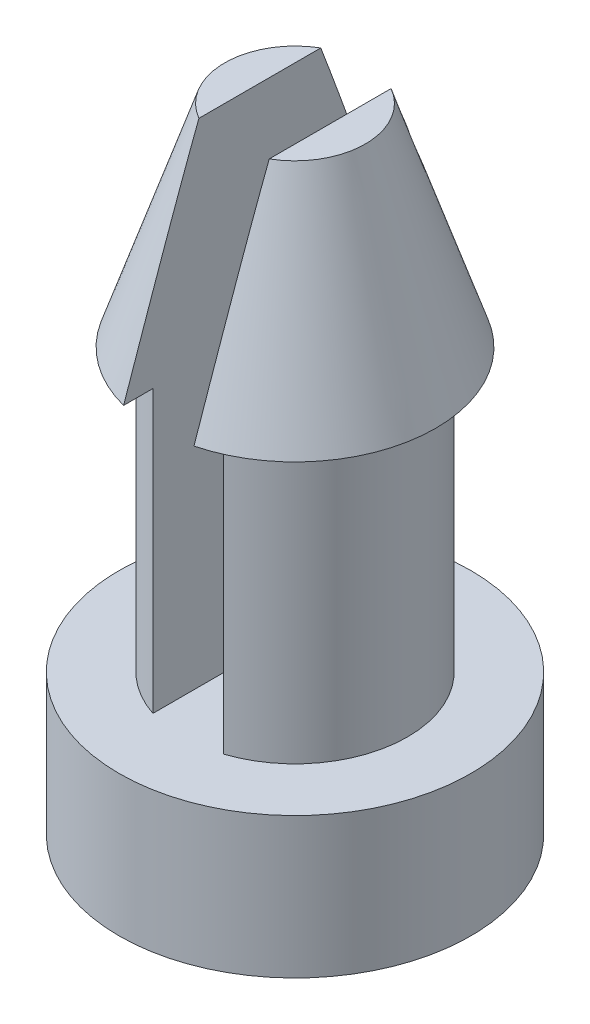
ISO-10303-21;
HEADER;
FILE_DESCRIPTION(('STEP AP214'),'2;1');
FILE_NAME('part.step','',(''),(''),'','','');
FILE_SCHEMA(('AUTOMOTIVE_DESIGN { 1 0 10303 214 1 1 1 1 }'));
ENDSEC;
DATA;
#1=APPLICATION_CONTEXT('core data for automotive mechanical design processes');
#2=APPLICATION_PROTOCOL_DEFINITION('international standard','automotive_design',2000,#1);
#3=PRODUCT_CONTEXT('',#1,'mechanical');
#4=PRODUCT('Part','Part','',(#3));
#5=PRODUCT_RELATED_PRODUCT_CATEGORY('part','',(#4));
#6=PRODUCT_DEFINITION_FORMATION('','',#4);
#7=PRODUCT_DEFINITION_CONTEXT('part definition',#1,'design');
#8=PRODUCT_DEFINITION('design','',#6,#7);
#9=PRODUCT_DEFINITION_SHAPE('','',#8);
#10=(LENGTH_UNIT() NAMED_UNIT(*) SI_UNIT(.MILLI.,.METRE.));
#11=(NAMED_UNIT(*) PLANE_ANGLE_UNIT() SI_UNIT($,.RADIAN.));
#12=(NAMED_UNIT(*) SI_UNIT($,.STERADIAN.) SOLID_ANGLE_UNIT());
#13=UNCERTAINTY_MEASURE_WITH_UNIT(LENGTH_MEASURE(1.E-05),#10,'distance_accuracy_value','');
#14=(GEOMETRIC_REPRESENTATION_CONTEXT(3) GLOBAL_UNCERTAINTY_ASSIGNED_CONTEXT((#13)) GLOBAL_UNIT_ASSIGNED_CONTEXT((#10,
#11,#12)) REPRESENTATION_CONTEXT('',''));
#15=CARTESIAN_POINT('',(0.,0.,0.));
#16=DIRECTION('',(0.,0.,1.));
#17=DIRECTION('',(1.,0.,0.));
#18=AXIS2_PLACEMENT_3D('',#15,#16,#17);
#19=CARTESIAN_POINT('',(0.,0.,0.));
#20=DIRECTION('',(0.,-1.,0.));
#21=DIRECTION('',(0.,0.,-1.));
#22=AXIS2_PLACEMENT_3D('',#19,#20,#21);
#23=CYLINDRICAL_SURFACE('',#22,2.54);
#24=DIRECTION('',(0.,-1.,0.));
#25=VECTOR('',#24,1.);
#26=CARTESIAN_POINT('',(-0.793749999999998,0.,-2.41279110937934));
#27=LINE('',#26,#25);
#28=CARTESIAN_POINT('',(-0.793749999999998,3.175,-2.41279110937934));
#29=VERTEX_POINT('',#28);
#30=CARTESIAN_POINT('',(-0.793749999999999,9.525,-2.41279110937934));
#31=VERTEX_POINT('',#30);
#32=EDGE_CURVE('E148',#29,#31,#27,.F.);
#33=ORIENTED_EDGE('',*,*,#32,.F.);
#34=CARTESIAN_POINT('',(0.,3.175,0.));
#35=DIRECTION('',(0.,-1.,0.));
#36=DIRECTION('',(0.,0.,-1.));
#37=AXIS2_PLACEMENT_3D('',#34,#35,#36);
#38=CIRCLE('',#37,2.54);
#39=CARTESIAN_POINT('',(-0.793749999999998,3.175,2.41279110937934));
#40=VERTEX_POINT('',#39);
#41=EDGE_CURVE('E125',#40,#29,#38,.T.);
#42=ORIENTED_EDGE('',*,*,#41,.F.);
#43=DIRECTION('',(0.,-1.,0.));
#44=VECTOR('',#43,1.);
#45=CARTESIAN_POINT('',(-0.793749999999998,0.,2.41279110937934));
#46=LINE('',#45,#44);
#47=CARTESIAN_POINT('',(-0.793749999999999,9.525,2.41279110937934));
#48=VERTEX_POINT('',#47);
#49=EDGE_CURVE('E146',#48,#40,#46,.T.);
#50=ORIENTED_EDGE('',*,*,#49,.F.);
#51=CARTESIAN_POINT('',(0.,9.525,0.));
#52=DIRECTION('',(0.,-1.,0.));
#53=DIRECTION('',(0.,0.,-1.));
#54=AXIS2_PLACEMENT_3D('',#51,#52,#53);
#55=CIRCLE('',#54,2.54);
#56=EDGE_CURVE('E131',#48,#31,#55,.T.);
#57=ORIENTED_EDGE('',*,*,#56,.T.);
#58=EDGE_LOOP('',(#33,#42,#50,#57));
#59=FACE_BOUND('',#58,.T.);
#60=ADVANCED_FACE('F41',(#59),#23,.T.);
#61=CARTESIAN_POINT('',(0.,9.525,0.));
#62=DIRECTION('',(0.,1.,0.));
#63=DIRECTION('',(0.,0.,1.));
#64=AXIS2_PLACEMENT_3D('',#61,#62,#63);
#65=PLANE('',#64);
#66=CARTESIAN_POINT('',(0.,9.525,0.));
#67=DIRECTION('',(0.,-1.,0.));
#68=DIRECTION('',(0.,0.,-1.));
#69=AXIS2_PLACEMENT_3D('',#66,#67,#68);
#70=CIRCLE('',#69,3.175);
#71=CARTESIAN_POINT('',(-0.793749999999999,9.525,3.07418053105214));
#72=VERTEX_POINT('',#71);
#73=CARTESIAN_POINT('',(-0.793749999999999,9.525,-3.07418053105214));
#74=VERTEX_POINT('',#73);
#75=EDGE_CURVE('E135',#72,#74,#70,.T.);
#76=ORIENTED_EDGE('',*,*,#75,.T.);
#77=DIRECTION('',(0.,0.,1.));
#78=VECTOR('',#77,1.);
#79=CARTESIAN_POINT('',(-0.793749999999999,9.525,0.));
#80=LINE('',#79,#78);
#81=EDGE_CURVE('E151',#74,#31,#80,.T.);
#82=ORIENTED_EDGE('',*,*,#81,.T.);
#83=ORIENTED_EDGE('',*,*,#56,.F.);
#84=EDGE_CURVE('E64',#48,#72,#80,.T.);
#85=ORIENTED_EDGE('',*,*,#84,.T.);
#86=EDGE_LOOP('',(#76,#82,#83,#85));
#87=FACE_BOUND('',#86,.T.);
#88=ADVANCED_FACE('F193',(#87),#65,.F.);
#89=CARTESIAN_POINT('',(0.,14.2875,0.));
#90=DIRECTION('',(0.,-1.,0.));
#91=DIRECTION('',(0.,0.,-1.));
#92=AXIS2_PLACEMENT_3D('',#89,#90,#91);
#93=CONICAL_SURFACE('',#92,1.5875,0.321750554396642);
#94=ORIENTED_EDGE('',*,*,#75,.F.);
#95=CARTESIAN_POINT('',(-0.793749999999999,9.5243,3.07442151609227));
#96=CARTESIAN_POINT('',(-0.793749999999999,9.70864325367533,3.01095661412919));
#97=CARTESIAN_POINT('',(-0.793749999999999,9.89295019709172,2.94738593836572));
#98=CARTESIAN_POINT('',(-0.793749999999999,10.2614733172808,2.81997730621189));
#99=CARTESIAN_POINT('',(-0.793749999999999,10.4456894933135,2.75613934768174));
#100=CARTESIAN_POINT('',(-0.793749999999999,10.9989822327712,2.56386028566071));
#101=CARTESIAN_POINT('',(-0.79375,11.3678900025934,2.43493334350211));
#102=CARTESIAN_POINT('',(-0.79375,12.1271676755757,2.16727681690671));
#103=CARTESIAN_POINT('',(-0.79375,12.5174943712571,2.02842392422531));
#104=CARTESIAN_POINT('',(-0.79375,13.1014662428339,1.81723841588544));
#105=CARTESIAN_POINT('',(-0.79375,13.2956641271333,1.7464359655978));
#106=CARTESIAN_POINT('',(-0.79375,13.6835127099418,1.60337831773535));
#107=CARTESIAN_POINT('',(-0.79375,13.8771634419601,1.53112321142561));
#108=CARTESIAN_POINT('',(-0.79375,14.1726002482872,1.41898752660588));
#109=CARTESIAN_POINT('',(-0.79375,14.2746840694561,1.37989196078648));
#110=CARTESIAN_POINT('',(-0.79375,14.4785650982894,1.30091108813334));
#111=CARTESIAN_POINT('',(-0.79375,14.5803622578216,1.2610256567681));
#112=CARTESIAN_POINT('',(-0.79375,14.7840988690684,1.18001768376987));
#113=CARTESIAN_POINT('',(-0.79375,14.8860361372565,1.13888963873966));
#114=CARTESIAN_POINT('',(-0.79375,15.0892896591,1.05526736567719));
#115=CARTESIAN_POINT('',(-0.79375,15.1906062097077,1.01277386353));
#116=CARTESIAN_POINT('',(-0.79375,15.3901917608087,0.926784972069538));
#117=CARTESIAN_POINT('',(-0.79375,15.4884789296943,0.883331864248625));
#118=CARTESIAN_POINT('',(-0.79375,15.6840109509216,0.793602865785596));
#119=CARTESIAN_POINT('',(-0.79375,15.7812534056772,0.74732165208845));
#120=CARTESIAN_POINT('',(-0.79375,15.9250162738515,0.674787197952603));
#121=CARTESIAN_POINT('',(-0.79375,15.9723785153785,0.650207813661779));
#122=CARTESIAN_POINT('',(-0.79375,16.0663151545602,0.59959342431616));
#123=CARTESIAN_POINT('',(-0.79375,16.1128897058036,0.573558707394662));
#124=CARTESIAN_POINT('',(-0.79375,16.2047277572804,0.519578551109119));
#125=CARTESIAN_POINT('',(-0.79375,16.2499948975128,0.491639332514471));
#126=CARTESIAN_POINT('',(-0.79375,16.3386476211257,0.432941943196636));
#127=CARTESIAN_POINT('',(-0.79375,16.382035553104,0.402187450040028));
#128=CARTESIAN_POINT('',(-0.79375,16.4392148245302,0.356982845465313));
#129=CARTESIAN_POINT('',(-0.79375,16.4544897182994,0.34441512993058));
#130=CARTESIAN_POINT('',(-0.79375,16.4844153522136,0.31853238205921));
#131=CARTESIAN_POINT('',(-0.79375,16.4990656816962,0.305216870969121));
#132=CARTESIAN_POINT('',(-0.79375,16.5274476438287,0.277769771660078));
#133=CARTESIAN_POINT('',(-0.79375,16.5411834949467,0.263642585952983));
#134=CARTESIAN_POINT('',(-0.79375,16.5674881869694,0.234348062735739));
#135=CARTESIAN_POINT('',(-0.79375,16.5800580534197,0.2191816600873));
#136=CARTESIAN_POINT('',(-0.79375,16.6030780563985,0.188269478285022));
#137=CARTESIAN_POINT('',(-0.79375,16.6135945581486,0.172573940301297));
#138=CARTESIAN_POINT('',(-0.79375,16.6325127179093,0.139919323782055));
#139=CARTESIAN_POINT('',(-0.79375,16.6409143740774,0.122960244145779));
#140=CARTESIAN_POINT('',(-0.79375,16.6537539384199,0.0904427195819594));
#141=CARTESIAN_POINT('',(-0.79375,16.6585936509673,0.0750465017342836));
#142=CARTESIAN_POINT('',(-0.79375,16.6656085136102,0.0436682626040638));
#143=CARTESIAN_POINT('',(-0.79375,16.6677887236516,0.0276874135199858));
#144=CARTESIAN_POINT('',(-0.79375,16.669202164822,-0.00447448282048815));
#145=CARTESIAN_POINT('',(-0.79375,16.6684234260672,-0.0206560787263561));
#146=CARTESIAN_POINT('',(-0.79375,16.6640046162712,-0.0526288676738726));
#147=CARTESIAN_POINT('',(-0.79375,16.6603606803324,-0.0684195036465102));
#148=CARTESIAN_POINT('',(-0.79375,16.6492452828165,-0.103707915296005));
#149=CARTESIAN_POINT('',(-0.79375,16.6409684594983,-0.122946903540195));
#150=CARTESIAN_POINT('',(-0.79375,16.6215310760103,-0.15989670333274));
#151=CARTESIAN_POINT('',(-0.79375,16.61036352903,-0.177603671720214));
#152=CARTESIAN_POINT('',(-0.79375,16.5750478178075,-0.227074752474278));
#153=CARTESIAN_POINT('',(-0.79375,16.5483339119709,-0.256970757553489));
#154=CARTESIAN_POINT('',(-0.79375,16.4913642240698,-0.3131411539281));
#155=CARTESIAN_POINT('',(-0.79375,16.4610950340029,-0.339400965050731));
#156=CARTESIAN_POINT('',(-0.79375,16.3978056463724,-0.389960817514382));
#157=CARTESIAN_POINT('',(-0.79375,16.3647375000604,-0.414200263239289));
#158=CARTESIAN_POINT('',(-0.79375,16.29727750224,-0.46077748494907));
#159=CARTESIAN_POINT('',(-0.79375,16.2628846848185,-0.483113833615575));
#160=CARTESIAN_POINT('',(-0.79375,16.1582558863592,-0.548131946140139));
#161=CARTESIAN_POINT('',(-0.79375,16.0867214367784,-0.588710682721495));
#162=CARTESIAN_POINT('',(-0.79375,15.9415416139269,-0.666703447878918));
#163=CARTESIAN_POINT('',(-0.79375,15.8678874740316,-0.704100637506216));
#164=CARTESIAN_POINT('',(-0.79375,15.7195920719858,-0.776571748578168));
#165=CARTESIAN_POINT('',(-0.79375,15.6449525436175,-0.811649229808802));
#166=CARTESIAN_POINT('',(-0.79375,15.495985753687,-0.879738598773763));
#167=CARTESIAN_POINT('',(-0.79375,15.4216683743195,-0.912772297165253));
#168=CARTESIAN_POINT('',(-0.79375,15.2725301448295,-0.977685887568333));
#169=CARTESIAN_POINT('',(-0.79375,15.197709278607,-1.00956574247343));
#170=CARTESIAN_POINT('',(-0.79375,14.9726747342844,-1.10390410527154));
#171=CARTESIAN_POINT('',(-0.79375,14.8219124181898,-1.1650509954539));
#172=CARTESIAN_POINT('',(-0.79375,14.5193595272673,-1.28520773492084));
#173=CARTESIAN_POINT('',(-0.79375,14.3675680220554,-1.34421521870201));
#174=CARTESIAN_POINT('',(-0.79375,14.063419065364,-1.46070911125684));
#175=CARTESIAN_POINT('',(-0.79375,13.9110616656244,-1.51819565536786));
#176=CARTESIAN_POINT('',(-0.79375,13.606598143186,-1.63183993399551));
#177=CARTESIAN_POINT('',(-0.79375,13.4544937492315,-1.68800231326989));
#178=CARTESIAN_POINT('',(-0.79375,13.1499873800809,-1.79952383731553));
#179=CARTESIAN_POINT('',(-0.79375,12.9975853983797,-1.85488296429949));
#180=CARTESIAN_POINT('',(-0.79375,12.5401839546664,-2.01999898298752));
#181=CARTESIAN_POINT('',(-0.79375,12.2348554884836,-2.12884391387009));
#182=CARTESIAN_POINT('',(-0.79375,11.7294311475977,-2.30760272031446));
#183=CARTESIAN_POINT('',(-0.79375,11.5294887208131,-2.37795241074788));
#184=CARTESIAN_POINT('',(-0.79375,11.1294013624571,-2.5181511338395));
#185=CARTESIAN_POINT('',(-0.79375,10.9292564094598,-2.5880001053903));
#186=CARTESIAN_POINT('',(-0.79375,10.5283602742576,-2.72746492301838));
#187=CARTESIAN_POINT('',(-0.793749999999999,10.3276087694937,-2.7970798409416));
#188=CARTESIAN_POINT('',(-0.793749999999999,9.92601900355539,-2.9359782482437));
#189=CARTESIAN_POINT('',(-0.793749999999999,9.72518075623715,-3.00526177767588));
#190=CARTESIAN_POINT('',(-0.793749999999999,9.5243,-3.07442151609229));
#191=B_SPLINE_CURVE_WITH_KNOTS('',3,(#95,#96,#97,#98,#99,#100,#101,#102,#103,#104,#105,#106,
#107,#108,#109,#110,#111,#112,#113,#114,#115,#116,#117,#118,#119,#120,#121,#122,#123,#124,#125,
#126,#127,#128,#129,#130,#131,#132,#133,#134,#135,#136,#137,#138,#139,#140,#141,#142,#143,#144,
#145,#146,#147,#148,#149,#150,#151,#152,#153,#154,#155,#156,#157,#158,#159,#160,#161,#162,#163,
#164,#165,#166,#167,#168,#169,#170,#171,#172,#173,#174,#175,#176,#177,#178,#179,#180,#181,#182,
#183,#184,#185,#186,#187,#188,#189,#190),.UNSPECIFIED.,.F.,.F.,(4,2,2,2,2,2,2,2,2,2,2,2,2,2,2,2,
2,2,2,2,2,2,2,2,2,2,2,2,2,2,2,2,2,2,2,2,2,2,2,2,2,2,2,2,2,2,2,4),(0.,0.584886487856575,
1.16977766711163,2.34213898497468,3.5849890847832,4.20509239906185,4.82515687550908,
5.15309681144134,5.48108886917711,5.81084641898107,6.14043147711937,6.46280324474104,
6.78580167640717,6.94586602094756,7.10589878670319,7.2654317961233,7.42475930458722,
7.48408292374499,7.54344496589466,7.60251087093547,7.66152432173749,7.71808625252809,
7.77464823259427,7.82286960212244,7.87099908228231,7.91932346830254,7.96771315170812,
8.03018774688744,8.09281477501431,8.21242194555966,8.33249562008661,8.4553924936856,
8.57838074285677,8.82492156170467,9.07269514957584,9.3200792347008,9.56405265902934,
9.80803392234936,10.2960730135332,10.7846362135242,11.2731557926104,11.7595783639008,
12.2460116902005,13.2184512999501,13.8543239397936,14.4902729033198,15.1277101866306,
15.7650683738438),.UNSPECIFIED.);
#192=CARTESIAN_POINT('',(-0.79375,14.2875,1.3748153285078));
#193=VERTEX_POINT('',#192);
#194=EDGE_CURVE('E150',#72,#193,#191,.T.);
#195=ORIENTED_EDGE('',*,*,#194,.T.);
#196=CARTESIAN_POINT('',(0.,14.2875,0.));
#197=DIRECTION('',(0.,-1.,0.));
#198=DIRECTION('',(0.,0.,-1.));
#199=AXIS2_PLACEMENT_3D('',#196,#197,#198);
#200=CIRCLE('',#199,1.5875);
#201=CARTESIAN_POINT('',(-0.79375,14.2875,-1.3748153285078));
#202=VERTEX_POINT('',#201);
#203=EDGE_CURVE('E139',#193,#202,#200,.T.);
#204=ORIENTED_EDGE('',*,*,#203,.T.);
#205=EDGE_CURVE('E115',#202,#74,#191,.T.);
#206=ORIENTED_EDGE('',*,*,#205,.T.);
#207=EDGE_LOOP('',(#94,#195,#204,#206));
#208=FACE_BOUND('',#207,.T.);
#209=ADVANCED_FACE('F188',(#208),#93,.T.);
#210=CARTESIAN_POINT('',(0.,14.2875,0.));
#211=DIRECTION('',(0.,-1.,0.));
#212=DIRECTION('',(0.,0.,-1.));
#213=AXIS2_PLACEMENT_3D('',#210,#211,#212);
#214=PLANE('',#213);
#215=ORIENTED_EDGE('',*,*,#203,.F.);
#216=DIRECTION('',(0.,0.,-1.));
#217=VECTOR('',#216,1.);
#218=CARTESIAN_POINT('',(-0.79375,14.2875,0.));
#219=LINE('',#218,#217);
#220=EDGE_CURVE('E11',#193,#202,#219,.T.);
#221=ORIENTED_EDGE('',*,*,#220,.T.);
#222=EDGE_LOOP('',(#215,#221));
#223=FACE_BOUND('',#222,.T.);
#224=ADVANCED_FACE('F182',(#223),#214,.F.);
#225=CARTESIAN_POINT('',(0.,3.175,0.));
#226=DIRECTION('',(0.,1.,0.));
#227=DIRECTION('',(0.,0.,1.));
#228=AXIS2_PLACEMENT_3D('',#225,#226,#227);
#229=PLANE('',#228);
#230=ORIENTED_EDGE('',*,*,#41,.T.);
#231=DIRECTION('',(0.,0.,1.));
#232=VECTOR('',#231,1.);
#233=CARTESIAN_POINT('',(-0.793749999999998,3.175,-3.96875));
#234=LINE('',#233,#232);
#235=EDGE_CURVE('E121',#29,#40,#234,.T.);
#236=ORIENTED_EDGE('',*,*,#235,.T.);
#237=EDGE_LOOP('',(#230,#236));
#238=FACE_BOUND('',#237,.T.);
#239=CARTESIAN_POINT('',(0.793749999999998,3.175,-2.41279110937934));
#240=VERTEX_POINT('',#239);
#241=CARTESIAN_POINT('',(0.793749999999998,3.175,2.41279110937934));
#242=VERTEX_POINT('',#241);
#243=EDGE_CURVE('E120',#240,#242,#38,.T.);
#244=ORIENTED_EDGE('',*,*,#243,.T.);
#245=DIRECTION('',(0.,0.,1.));
#246=VECTOR('',#245,1.);
#247=CARTESIAN_POINT('',(0.793749999999998,3.175,-3.96875));
#248=LINE('',#247,#246);
#249=EDGE_CURVE('E107',#240,#242,#248,.T.);
#250=ORIENTED_EDGE('',*,*,#249,.F.);
#251=EDGE_LOOP('',(#244,#250));
#252=FACE_BOUND('',#251,.T.);
#253=CARTESIAN_POINT('',(0.,3.175,0.));
#254=DIRECTION('',(0.,-1.,0.));
#255=DIRECTION('',(0.,0.,-1.));
#256=AXIS2_PLACEMENT_3D('',#253,#254,#255);
#257=CIRCLE('',#256,3.96875);
#258=CARTESIAN_POINT('',(0.,3.175,-3.96875));
#259=VERTEX_POINT('',#258);
#260=EDGE_CURVE('E143',#259,#259,#257,.T.);
#261=ORIENTED_EDGE('',*,*,#260,.F.);
#262=EDGE_LOOP('',(#261));
#263=FACE_BOUND('',#262,.T.);
#264=ADVANCED_FACE('F43',(#238,#252,#263),#229,.T.);
#265=DIRECTION('',(0.,-1.,0.));
#266=VECTOR('',#265,1.);
#267=CARTESIAN_POINT('',(0.793749999999998,0.,2.41279110937934));
#268=LINE('',#267,#266);
#269=CARTESIAN_POINT('',(0.793749999999999,9.525,2.41279110937934));
#270=VERTEX_POINT('',#269);
#271=EDGE_CURVE('E124',#242,#270,#268,.F.);
#272=ORIENTED_EDGE('',*,*,#271,.F.);
#273=ORIENTED_EDGE('',*,*,#243,.F.);
#274=DIRECTION('',(0.,-1.,0.));
#275=VECTOR('',#274,1.);
#276=CARTESIAN_POINT('',(0.793749999999998,0.,-2.41279110937934));
#277=LINE('',#276,#275);
#278=CARTESIAN_POINT('',(0.793749999999999,9.525,-2.41279110937934));
#279=VERTEX_POINT('',#278);
#280=EDGE_CURVE('E104',#279,#240,#277,.T.);
#281=ORIENTED_EDGE('',*,*,#280,.F.);
#282=EDGE_CURVE('E128',#279,#270,#55,.T.);
#283=ORIENTED_EDGE('',*,*,#282,.T.);
#284=EDGE_LOOP('',(#272,#273,#281,#283));
#285=FACE_BOUND('',#284,.T.);
#286=ADVANCED_FACE('F123',(#285),#23,.T.);
#287=CARTESIAN_POINT('',(0.793749999999999,9.525,-3.07418053105214));
#288=VERTEX_POINT('',#287);
#289=CARTESIAN_POINT('',(0.793749999999999,9.525,3.07418053105214));
#290=VERTEX_POINT('',#289);
#291=EDGE_CURVE('E132',#288,#290,#70,.T.);
#292=ORIENTED_EDGE('',*,*,#291,.T.);
#293=DIRECTION('',(0.,0.,-1.));
#294=VECTOR('',#293,1.);
#295=CARTESIAN_POINT('',(0.793749999999999,9.525,0.));
#296=LINE('',#295,#294);
#297=EDGE_CURVE('E301',#290,#270,#296,.T.);
#298=ORIENTED_EDGE('',*,*,#297,.T.);
#299=ORIENTED_EDGE('',*,*,#282,.F.);
#300=EDGE_CURVE('E110',#279,#288,#296,.T.);
#301=ORIENTED_EDGE('',*,*,#300,.T.);
#302=EDGE_LOOP('',(#292,#298,#299,#301));
#303=FACE_BOUND('',#302,.T.);
#304=ADVANCED_FACE('F186',(#303),#65,.F.);
#305=ORIENTED_EDGE('',*,*,#291,.F.);
#306=CARTESIAN_POINT('',(0.793749999999999,9.5243,-3.07442151609227));
#307=CARTESIAN_POINT('',(0.793749999999999,9.70864325367533,-3.01095661412919));
#308=CARTESIAN_POINT('',(0.793749999999999,9.89295019709172,-2.94738593836572));
#309=CARTESIAN_POINT('',(0.793749999999999,10.2614733172808,-2.81997730621189));
#310=CARTESIAN_POINT('',(0.793749999999999,10.4456894933135,-2.75613934768174));
#311=CARTESIAN_POINT('',(0.793749999999999,10.9989822327712,-2.56386028566071));
#312=CARTESIAN_POINT('',(0.79375,11.3678900025934,-2.43493334350211));
#313=CARTESIAN_POINT('',(0.79375,12.1271676755757,-2.16727681690671));
#314=CARTESIAN_POINT('',(0.79375,12.5174943712571,-2.02842392422531));
#315=CARTESIAN_POINT('',(0.79375,13.1014662428339,-1.81723841588544));
#316=CARTESIAN_POINT('',(0.79375,13.2956641271333,-1.7464359655978));
#317=CARTESIAN_POINT('',(0.79375,13.6835127099418,-1.60337831773535));
#318=CARTESIAN_POINT('',(0.79375,13.8771634419601,-1.53112321142561));
#319=CARTESIAN_POINT('',(0.79375,14.1726002482872,-1.41898752660588));
#320=CARTESIAN_POINT('',(0.79375,14.2746840694561,-1.37989196078648));
#321=CARTESIAN_POINT('',(0.79375,14.4785650982894,-1.30091108813334));
#322=CARTESIAN_POINT('',(0.79375,14.5803622578216,-1.2610256567681));
#323=CARTESIAN_POINT('',(0.79375,14.7840988690684,-1.18001768376987));
#324=CARTESIAN_POINT('',(0.79375,14.8860361372565,-1.13888963873966));
#325=CARTESIAN_POINT('',(0.79375,15.0892896591,-1.05526736567719));
#326=CARTESIAN_POINT('',(0.79375,15.1906062097077,-1.01277386353));
#327=CARTESIAN_POINT('',(0.79375,15.3901917608087,-0.926784972069538));
#328=CARTESIAN_POINT('',(0.79375,15.4884789296943,-0.883331864248625));
#329=CARTESIAN_POINT('',(0.79375,15.6840109509216,-0.793602865785596));
#330=CARTESIAN_POINT('',(0.79375,15.7812534056772,-0.74732165208845));
#331=CARTESIAN_POINT('',(0.79375,15.9250162738515,-0.674787197952603));
#332=CARTESIAN_POINT('',(0.79375,15.9723785153785,-0.650207813661779));
#333=CARTESIAN_POINT('',(0.79375,16.0663151545602,-0.59959342431616));
#334=CARTESIAN_POINT('',(0.79375,16.1128897058036,-0.573558707394662));
#335=CARTESIAN_POINT('',(0.79375,16.2047277572804,-0.519578551109119));
#336=CARTESIAN_POINT('',(0.79375,16.2499948975128,-0.491639332514471));
#337=CARTESIAN_POINT('',(0.79375,16.3386476211257,-0.432941943196636));
#338=CARTESIAN_POINT('',(0.79375,16.382035553104,-0.402187450040028));
#339=CARTESIAN_POINT('',(0.79375,16.4392148245302,-0.356982845465313));
#340=CARTESIAN_POINT('',(0.79375,16.4544897182994,-0.34441512993058));
#341=CARTESIAN_POINT('',(0.79375,16.4844153522136,-0.31853238205921));
#342=CARTESIAN_POINT('',(0.79375,16.4990656816962,-0.305216870969121));
#343=CARTESIAN_POINT('',(0.79375,16.5274476438287,-0.277769771660078));
#344=CARTESIAN_POINT('',(0.79375,16.5411834949467,-0.263642585952983));
#345=CARTESIAN_POINT('',(0.79375,16.5674881869694,-0.234348062735739));
#346=CARTESIAN_POINT('',(0.79375,16.5800580534197,-0.2191816600873));
#347=CARTESIAN_POINT('',(0.79375,16.6030780563985,-0.188269478285022));
#348=CARTESIAN_POINT('',(0.79375,16.6135945581486,-0.172573940301297));
#349=CARTESIAN_POINT('',(0.79375,16.6325127179093,-0.139919323782055));
#350=CARTESIAN_POINT('',(0.79375,16.6409143740774,-0.122960244145779));
#351=CARTESIAN_POINT('',(0.79375,16.6537539384199,-0.0904427195819594));
#352=CARTESIAN_POINT('',(0.79375,16.6585936509673,-0.0750465017342836));
#353=CARTESIAN_POINT('',(0.79375,16.6656085136102,-0.0436682626040638));
#354=CARTESIAN_POINT('',(0.79375,16.6677887236516,-0.0276874135199858));
#355=CARTESIAN_POINT('',(0.79375,16.669202164822,0.00447448282048815));
#356=CARTESIAN_POINT('',(0.79375,16.6684234260672,0.0206560787263561));
#357=CARTESIAN_POINT('',(0.79375,16.6640046162712,0.0526288676738726));
#358=CARTESIAN_POINT('',(0.79375,16.6603606803324,0.0684195036465102));
#359=CARTESIAN_POINT('',(0.79375,16.6492452828165,0.103707915296005));
#360=CARTESIAN_POINT('',(0.79375,16.6409684594983,0.122946903540195));
#361=CARTESIAN_POINT('',(0.79375,16.6215310760103,0.15989670333274));
#362=CARTESIAN_POINT('',(0.79375,16.61036352903,0.177603671720214));
#363=CARTESIAN_POINT('',(0.79375,16.5750478178075,0.227074752474278));
#364=CARTESIAN_POINT('',(0.79375,16.5483339119709,0.256970757553489));
#365=CARTESIAN_POINT('',(0.79375,16.4913642240698,0.3131411539281));
#366=CARTESIAN_POINT('',(0.79375,16.4610950340029,0.339400965050731));
#367=CARTESIAN_POINT('',(0.79375,16.3978056463724,0.389960817514382));
#368=CARTESIAN_POINT('',(0.79375,16.3647375000604,0.414200263239289));
#369=CARTESIAN_POINT('',(0.79375,16.29727750224,0.46077748494907));
#370=CARTESIAN_POINT('',(0.79375,16.2628846848185,0.483113833615575));
#371=CARTESIAN_POINT('',(0.79375,16.1582558863592,0.548131946140139));
#372=CARTESIAN_POINT('',(0.79375,16.0867214367784,0.588710682721495));
#373=CARTESIAN_POINT('',(0.79375,15.9415416139269,0.666703447878918));
#374=CARTESIAN_POINT('',(0.79375,15.8678874740316,0.704100637506216));
#375=CARTESIAN_POINT('',(0.79375,15.7195920719858,0.776571748578168));
#376=CARTESIAN_POINT('',(0.79375,15.6449525436175,0.811649229808802));
#377=CARTESIAN_POINT('',(0.79375,15.495985753687,0.879738598773763));
#378=CARTESIAN_POINT('',(0.79375,15.4216683743195,0.912772297165253));
#379=CARTESIAN_POINT('',(0.79375,15.2725301448295,0.977685887568333));
#380=CARTESIAN_POINT('',(0.79375,15.197709278607,1.00956574247343));
#381=CARTESIAN_POINT('',(0.79375,14.9726747342844,1.10390410527154));
#382=CARTESIAN_POINT('',(0.79375,14.8219124181898,1.1650509954539));
#383=CARTESIAN_POINT('',(0.79375,14.5193595272673,1.28520773492084));
#384=CARTESIAN_POINT('',(0.79375,14.3675680220554,1.34421521870201));
#385=CARTESIAN_POINT('',(0.79375,14.063419065364,1.46070911125684));
#386=CARTESIAN_POINT('',(0.79375,13.9110616656244,1.51819565536786));
#387=CARTESIAN_POINT('',(0.79375,13.606598143186,1.63183993399551));
#388=CARTESIAN_POINT('',(0.79375,13.4544937492315,1.68800231326989));
#389=CARTESIAN_POINT('',(0.79375,13.1499873800809,1.79952383731553));
#390=CARTESIAN_POINT('',(0.79375,12.9975853983797,1.85488296429949));
#391=CARTESIAN_POINT('',(0.79375,12.5401839546664,2.01999898298752));
#392=CARTESIAN_POINT('',(0.79375,12.2348554884836,2.12884391387009));
#393=CARTESIAN_POINT('',(0.79375,11.7294311475977,2.30760272031446));
#394=CARTESIAN_POINT('',(0.79375,11.5294887208131,2.37795241074788));
#395=CARTESIAN_POINT('',(0.79375,11.1294013624571,2.5181511338395));
#396=CARTESIAN_POINT('',(0.79375,10.9292564094598,2.5880001053903));
#397=CARTESIAN_POINT('',(0.79375,10.5283602742576,2.72746492301838));
#398=CARTESIAN_POINT('',(0.793749999999999,10.3276087694937,2.7970798409416));
#399=CARTESIAN_POINT('',(0.793749999999999,9.92601900355539,2.9359782482437));
#400=CARTESIAN_POINT('',(0.793749999999999,9.72518075623715,3.00526177767588));
#401=CARTESIAN_POINT('',(0.793749999999999,9.5243,3.07442151609229));
#402=B_SPLINE_CURVE_WITH_KNOTS('',3,(#306,#307,#308,#309,#310,#311,#312,#313,#314,#315,#316,
#317,#318,#319,#320,#321,#322,#323,#324,#325,#326,#327,#328,#329,#330,#331,#332,#333,#334,#335,
#336,#337,#338,#339,#340,#341,#342,#343,#344,#345,#346,#347,#348,#349,#350,#351,#352,#353,#354,
#355,#356,#357,#358,#359,#360,#361,#362,#363,#364,#365,#366,#367,#368,#369,#370,#371,#372,#373,
#374,#375,#376,#377,#378,#379,#380,#381,#382,#383,#384,#385,#386,#387,#388,#389,#390,#391,#392,
#393,#394,#395,#396,#397,#398,#399,#400,#401),.UNSPECIFIED.,.F.,.F.,(4,2,2,2,2,2,2,2,2,2,2,2,2,
2,2,2,2,2,2,2,2,2,2,2,2,2,2,2,2,2,2,2,2,2,2,2,2,2,2,2,2,2,2,2,2,2,2,4),(0.,0.584886487856575,
1.16977766711163,2.34213898497468,3.5849890847832,4.20509239906185,4.82515687550908,
5.15309681144134,5.48108886917711,5.81084641898107,6.14043147711937,6.46280324474104,
6.78580167640717,6.94586602094756,7.10589878670319,7.2654317961233,7.42475930458722,
7.48408292374499,7.54344496589466,7.60251087093547,7.66152432173749,7.71808625252809,
7.77464823259427,7.82286960212244,7.87099908228231,7.91932346830254,7.96771315170812,
8.03018774688744,8.09281477501431,8.21242194555966,8.33249562008661,8.4553924936856,
8.57838074285677,8.82492156170467,9.07269514957584,9.3200792347008,9.56405265902934,
9.80803392234936,10.2960730135332,10.7846362135242,11.2731557926104,11.7595783639008,
12.2460116902005,13.2184512999501,13.8543239397936,14.4902729033198,15.1277101866306,
15.7650683738438),.UNSPECIFIED.);
#403=CARTESIAN_POINT('',(0.79375,14.2875,-1.3748153285078));
#404=VERTEX_POINT('',#403);
#405=EDGE_CURVE('E302',#288,#404,#402,.T.);
#406=ORIENTED_EDGE('',*,*,#405,.T.);
#407=CARTESIAN_POINT('',(0.79375,14.2875,1.3748153285078));
#408=VERTEX_POINT('',#407);
#409=EDGE_CURVE('E136',#404,#408,#200,.T.);
#410=ORIENTED_EDGE('',*,*,#409,.T.);
#411=EDGE_CURVE('E56',#408,#290,#402,.T.);
#412=ORIENTED_EDGE('',*,*,#411,.T.);
#413=EDGE_LOOP('',(#305,#406,#410,#412));
#414=FACE_BOUND('',#413,.T.);
#415=ADVANCED_FACE('F162',(#414),#93,.T.);
#416=ORIENTED_EDGE('',*,*,#409,.F.);
#417=DIRECTION('',(0.,0.,1.));
#418=VECTOR('',#417,1.);
#419=CARTESIAN_POINT('',(0.79375,14.2875,0.));
#420=LINE('',#419,#418);
#421=EDGE_CURVE('E49',#404,#408,#420,.T.);
#422=ORIENTED_EDGE('',*,*,#421,.T.);
#423=EDGE_LOOP('',(#416,#422));
#424=FACE_BOUND('',#423,.T.);
#425=ADVANCED_FACE('F178',(#424),#214,.F.);
#426=CARTESIAN_POINT('',(0.,0.,0.));
#427=DIRECTION('',(0.,-1.,0.));
#428=DIRECTION('',(0.,0.,-1.));
#429=AXIS2_PLACEMENT_3D('',#426,#427,#428);
#430=PLANE('',#429);
#431=CARTESIAN_POINT('',(0.,0.,0.));
#432=DIRECTION('',(0.,-1.,0.));
#433=DIRECTION('',(0.,0.,-1.));
#434=AXIS2_PLACEMENT_3D('',#431,#432,#433);
#435=CIRCLE('',#434,3.96875);
#436=CARTESIAN_POINT('',(0.,0.,-3.96875));
#437=VERTEX_POINT('',#436);
#438=EDGE_CURVE('E140',#437,#437,#435,.T.);
#439=ORIENTED_EDGE('',*,*,#438,.T.);
#440=EDGE_LOOP('',(#439));
#441=FACE_BOUND('',#440,.T.);
#442=ADVANCED_FACE('F175',(#441),#430,.T.);
#443=CARTESIAN_POINT('',(0.,0.,0.));
#444=DIRECTION('',(0.,-1.,0.));
#445=DIRECTION('',(0.,0.,-1.));
#446=AXIS2_PLACEMENT_3D('',#443,#444,#445);
#447=CYLINDRICAL_SURFACE('',#446,3.96875);
#448=ORIENTED_EDGE('',*,*,#260,.T.);
#449=EDGE_LOOP('',(#448));
#450=FACE_BOUND('',#449,.T.);
#451=ORIENTED_EDGE('',*,*,#438,.F.);
#452=EDGE_LOOP('',(#451));
#453=FACE_BOUND('',#452,.T.);
#454=ADVANCED_FACE('F171',(#450,#453),#447,.T.);
#455=CARTESIAN_POINT('',(-0.79375,14.2875,-3.96875));
#456=DIRECTION('',(-1.,0.,0.));
#457=DIRECTION('',(0.,-1.,0.));
#458=AXIS2_PLACEMENT_3D('',#455,#456,#457);
#459=PLANE('',#458);
#460=ORIENTED_EDGE('',*,*,#49,.T.);
#461=ORIENTED_EDGE('',*,*,#235,.F.);
#462=ORIENTED_EDGE('',*,*,#32,.T.);
#463=ORIENTED_EDGE('',*,*,#81,.F.);
#464=ORIENTED_EDGE('',*,*,#205,.F.);
#465=ORIENTED_EDGE('',*,*,#220,.F.);
#466=ORIENTED_EDGE('',*,*,#194,.F.);
#467=ORIENTED_EDGE('',*,*,#84,.F.);
#468=EDGE_LOOP('',(#460,#461,#462,#463,#464,#465,#466,#467));
#469=FACE_BOUND('',#468,.T.);
#470=ADVANCED_FACE('F166',(#469),#459,.F.);
#471=CARTESIAN_POINT('',(0.79375,14.2875,-3.96875));
#472=DIRECTION('',(1.,0.,0.));
#473=DIRECTION('',(0.,1.,0.));
#474=AXIS2_PLACEMENT_3D('',#471,#472,#473);
#475=PLANE('',#474);
#476=ORIENTED_EDGE('',*,*,#280,.T.);
#477=ORIENTED_EDGE('',*,*,#249,.T.);
#478=ORIENTED_EDGE('',*,*,#271,.T.);
#479=ORIENTED_EDGE('',*,*,#297,.F.);
#480=ORIENTED_EDGE('',*,*,#411,.F.);
#481=ORIENTED_EDGE('',*,*,#421,.F.);
#482=ORIENTED_EDGE('',*,*,#405,.F.);
#483=ORIENTED_EDGE('',*,*,#300,.F.);
#484=EDGE_LOOP('',(#476,#477,#478,#479,#480,#481,#482,#483));
#485=FACE_BOUND('',#484,.T.);
#486=ADVANCED_FACE('F106',(#485),#475,.F.);
#487=CLOSED_SHELL('',(#60,#88,#209,#224,#264,#286,#304,#415,#425,#442,#454,#470,#486));
#488=MANIFOLD_SOLID_BREP('B2',#487);
#489=ADVANCED_BREP_SHAPE_REPRESENTATION('',(#18,#488),#14);
#490=SHAPE_DEFINITION_REPRESENTATION(#9,#489);
ENDSEC;
END-ISO-10303-21;
